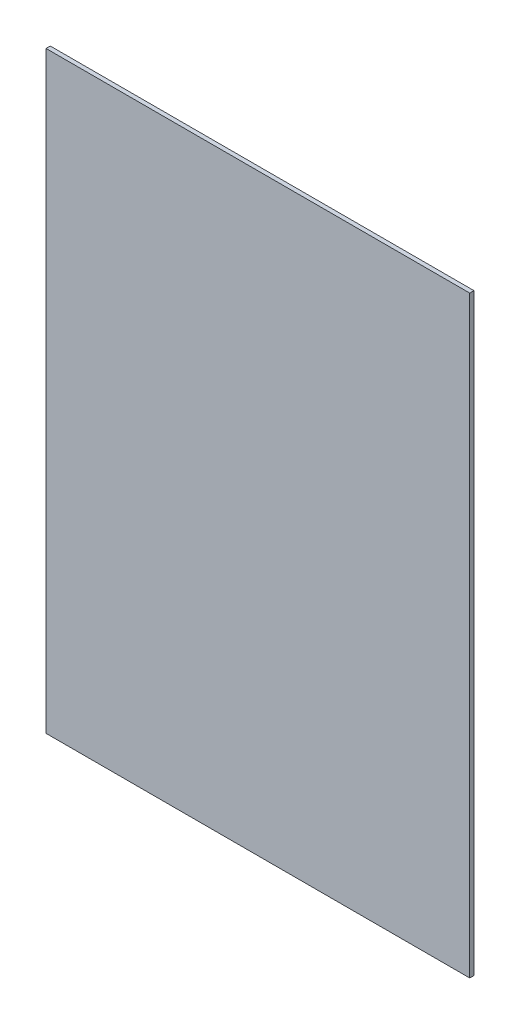
ISO-10303-21;
HEADER;
FILE_DESCRIPTION(('STEP AP214'),'2;1');
FILE_NAME('part.step','',(''),(''),'','','');
FILE_SCHEMA(('AUTOMOTIVE_DESIGN { 1 0 10303 214 1 1 1 1 }'));
ENDSEC;
DATA;
#1=APPLICATION_CONTEXT('core data for automotive mechanical design processes');
#2=APPLICATION_PROTOCOL_DEFINITION('international standard','automotive_design',2000,#1);
#3=PRODUCT_CONTEXT('',#1,'mechanical');
#4=PRODUCT('Part','Part','',(#3));
#5=PRODUCT_RELATED_PRODUCT_CATEGORY('part','',(#4));
#6=PRODUCT_DEFINITION_FORMATION('','',#4);
#7=PRODUCT_DEFINITION_CONTEXT('part definition',#1,'design');
#8=PRODUCT_DEFINITION('design','',#6,#7);
#9=PRODUCT_DEFINITION_SHAPE('','',#8);
#10=(LENGTH_UNIT() NAMED_UNIT(*) SI_UNIT(.MILLI.,.METRE.));
#11=(NAMED_UNIT(*) PLANE_ANGLE_UNIT() SI_UNIT($,.RADIAN.));
#12=(NAMED_UNIT(*) SI_UNIT($,.STERADIAN.) SOLID_ANGLE_UNIT());
#13=UNCERTAINTY_MEASURE_WITH_UNIT(LENGTH_MEASURE(1.E-05),#10,'distance_accuracy_value','');
#14=(GEOMETRIC_REPRESENTATION_CONTEXT(3) GLOBAL_UNCERTAINTY_ASSIGNED_CONTEXT((#13)) GLOBAL_UNIT_ASSIGNED_CONTEXT((#10,
#11,#12)) REPRESENTATION_CONTEXT('',''));
#15=CARTESIAN_POINT('',(0.,0.,0.));
#16=DIRECTION('',(0.,0.,1.));
#17=DIRECTION('',(1.,0.,0.));
#18=AXIS2_PLACEMENT_3D('',#15,#16,#17);
#19=CARTESIAN_POINT('',(537.989868276619,735.902471910112,5.));
#20=DIRECTION('',(-1.,0.,0.));
#21=DIRECTION('',(0.,0.,1.));
#22=AXIS2_PLACEMENT_3D('',#19,#20,#21);
#23=PLANE('',#22);
#24=DIRECTION('',(0.,1.,0.));
#25=VECTOR('',#24,1.);
#26=CARTESIAN_POINT('',(537.989868276619,735.902471910112,0.));
#27=LINE('',#26,#25);
#28=CARTESIAN_POINT('',(537.989868276619,35.9024719101124,0.));
#29=VERTEX_POINT('',#28);
#30=CARTESIAN_POINT('',(537.989868276619,735.902471910112,0.));
#31=VERTEX_POINT('',#30);
#32=EDGE_CURVE('E96',#29,#31,#27,.T.);
#33=ORIENTED_EDGE('',*,*,#32,.T.);
#34=DIRECTION('',(0.,0.,-1.));
#35=VECTOR('',#34,1.);
#36=CARTESIAN_POINT('',(537.989868276619,735.902471910112,5.));
#37=LINE('',#36,#35);
#38=CARTESIAN_POINT('',(537.989868276619,735.902471910112,5.));
#39=VERTEX_POINT('',#38);
#40=EDGE_CURVE('E11',#39,#31,#37,.T.);
#41=ORIENTED_EDGE('',*,*,#40,.F.);
#42=DIRECTION('',(0.,1.,0.));
#43=VECTOR('',#42,1.);
#44=CARTESIAN_POINT('',(537.989868276619,735.902471910112,5.));
#45=LINE('',#44,#43);
#46=CARTESIAN_POINT('',(537.989868276619,35.9024719101124,5.));
#47=VERTEX_POINT('',#46);
#48=EDGE_CURVE('E84',#47,#39,#45,.T.);
#49=ORIENTED_EDGE('',*,*,#48,.F.);
#50=DIRECTION('',(0.,0.,-1.));
#51=VECTOR('',#50,1.);
#52=CARTESIAN_POINT('',(537.989868276619,35.9024719101124,5.));
#53=LINE('',#52,#51);
#54=EDGE_CURVE('E92',#47,#29,#53,.T.);
#55=ORIENTED_EDGE('',*,*,#54,.T.);
#56=EDGE_LOOP('',(#33,#41,#49,#55));
#57=FACE_BOUND('',#56,.T.);
#58=ADVANCED_FACE('F33',(#57),#23,.F.);
#59=CARTESIAN_POINT('',(537.989868276619,735.902471910112,5.));
#60=DIRECTION('',(0.,-1.,0.));
#61=DIRECTION('',(0.,0.,-1.));
#62=AXIS2_PLACEMENT_3D('',#59,#60,#61);
#63=PLANE('',#62);
#64=DIRECTION('',(-1.,0.,0.));
#65=VECTOR('',#64,1.);
#66=CARTESIAN_POINT('',(537.989868276619,735.902471910112,0.));
#67=LINE('',#66,#65);
#68=CARTESIAN_POINT('',(37.989868276619,735.902471910112,0.));
#69=VERTEX_POINT('',#68);
#70=EDGE_CURVE('E88',#31,#69,#67,.T.);
#71=ORIENTED_EDGE('',*,*,#70,.T.);
#72=DIRECTION('',(0.,0.,-1.));
#73=VECTOR('',#72,1.);
#74=CARTESIAN_POINT('',(37.989868276619,735.902471910112,5.));
#75=LINE('',#74,#73);
#76=CARTESIAN_POINT('',(37.989868276619,735.902471910112,5.));
#77=VERTEX_POINT('',#76);
#78=EDGE_CURVE('E41',#77,#69,#75,.T.);
#79=ORIENTED_EDGE('',*,*,#78,.F.);
#80=DIRECTION('',(-1.,0.,0.));
#81=VECTOR('',#80,1.);
#82=CARTESIAN_POINT('',(537.989868276619,735.902471910112,5.));
#83=LINE('',#82,#81);
#84=EDGE_CURVE('E79',#39,#77,#83,.T.);
#85=ORIENTED_EDGE('',*,*,#84,.F.);
#86=ORIENTED_EDGE('',*,*,#40,.T.);
#87=EDGE_LOOP('',(#71,#79,#85,#86));
#88=FACE_BOUND('',#87,.T.);
#89=ADVANCED_FACE('F87',(#88),#63,.F.);
#90=CARTESIAN_POINT('',(37.989868276619,735.902471910112,5.));
#91=DIRECTION('',(1.,0.,0.));
#92=DIRECTION('',(0.,1.,0.));
#93=AXIS2_PLACEMENT_3D('',#90,#91,#92);
#94=PLANE('',#93);
#95=DIRECTION('',(0.,-1.,0.));
#96=VECTOR('',#95,1.);
#97=CARTESIAN_POINT('',(37.989868276619,735.902471910112,0.));
#98=LINE('',#97,#96);
#99=CARTESIAN_POINT('',(37.989868276619,35.9024719101124,0.));
#100=VERTEX_POINT('',#99);
#101=EDGE_CURVE('E66',#69,#100,#98,.T.);
#102=ORIENTED_EDGE('',*,*,#101,.T.);
#103=DIRECTION('',(0.,0.,-1.));
#104=VECTOR('',#103,1.);
#105=CARTESIAN_POINT('',(37.989868276619,35.9024719101124,5.));
#106=LINE('',#105,#104);
#107=CARTESIAN_POINT('',(37.989868276619,35.9024719101124,5.));
#108=VERTEX_POINT('',#107);
#109=EDGE_CURVE('E89',#108,#100,#106,.T.);
#110=ORIENTED_EDGE('',*,*,#109,.F.);
#111=DIRECTION('',(0.,-1.,0.));
#112=VECTOR('',#111,1.);
#113=CARTESIAN_POINT('',(37.989868276619,735.902471910112,5.));
#114=LINE('',#113,#112);
#115=EDGE_CURVE('E82',#77,#108,#114,.T.);
#116=ORIENTED_EDGE('',*,*,#115,.F.);
#117=ORIENTED_EDGE('',*,*,#78,.T.);
#118=EDGE_LOOP('',(#102,#110,#116,#117));
#119=FACE_BOUND('',#118,.T.);
#120=ADVANCED_FACE('F90',(#119),#94,.F.);
#121=CARTESIAN_POINT('',(537.989868276619,35.9024719101124,5.));
#122=DIRECTION('',(0.,1.,0.));
#123=DIRECTION('',(-1.,0.,0.));
#124=AXIS2_PLACEMENT_3D('',#121,#122,#123);
#125=PLANE('',#124);
#126=DIRECTION('',(1.,0.,0.));
#127=VECTOR('',#126,1.);
#128=CARTESIAN_POINT('',(537.989868276619,35.9024719101124,0.));
#129=LINE('',#128,#127);
#130=EDGE_CURVE('E72',#100,#29,#129,.T.);
#131=ORIENTED_EDGE('',*,*,#130,.T.);
#132=ORIENTED_EDGE('',*,*,#54,.F.);
#133=DIRECTION('',(1.,0.,0.));
#134=VECTOR('',#133,1.);
#135=CARTESIAN_POINT('',(537.989868276619,35.9024719101124,5.));
#136=LINE('',#135,#134);
#137=EDGE_CURVE('E49',#108,#47,#136,.T.);
#138=ORIENTED_EDGE('',*,*,#137,.F.);
#139=ORIENTED_EDGE('',*,*,#109,.T.);
#140=EDGE_LOOP('',(#131,#132,#138,#139));
#141=FACE_BOUND('',#140,.T.);
#142=ADVANCED_FACE('F103',(#141),#125,.F.);
#143=CARTESIAN_POINT('',(0.,0.,5.));
#144=DIRECTION('',(0.,0.,-1.));
#145=DIRECTION('',(-1.,0.,0.));
#146=AXIS2_PLACEMENT_3D('',#143,#144,#145);
#147=PLANE('',#146);
#148=ORIENTED_EDGE('',*,*,#48,.T.);
#149=ORIENTED_EDGE('',*,*,#84,.T.);
#150=ORIENTED_EDGE('',*,*,#115,.T.);
#151=ORIENTED_EDGE('',*,*,#137,.T.);
#152=EDGE_LOOP('',(#148,#149,#150,#151));
#153=FACE_BOUND('',#152,.T.);
#154=ADVANCED_FACE('F80',(#153),#147,.F.);
#155=CARTESIAN_POINT('',(0.,0.,0.));
#156=DIRECTION('',(0.,0.,-1.));
#157=DIRECTION('',(-1.,0.,0.));
#158=AXIS2_PLACEMENT_3D('',#155,#156,#157);
#159=PLANE('',#158);
#160=ORIENTED_EDGE('',*,*,#32,.F.);
#161=ORIENTED_EDGE('',*,*,#130,.F.);
#162=ORIENTED_EDGE('',*,*,#101,.F.);
#163=ORIENTED_EDGE('',*,*,#70,.F.);
#164=EDGE_LOOP('',(#160,#161,#162,#163));
#165=FACE_BOUND('',#164,.T.);
#166=ADVANCED_FACE('F106',(#165),#159,.T.);
#167=CLOSED_SHELL('',(#58,#89,#120,#142,#154,#166));
#168=MANIFOLD_SOLID_BREP('B2',#167);
#169=ADVANCED_BREP_SHAPE_REPRESENTATION('',(#18,#168),#14);
#170=SHAPE_DEFINITION_REPRESENTATION(#9,#169);
ENDSEC;
END-ISO-10303-21;
